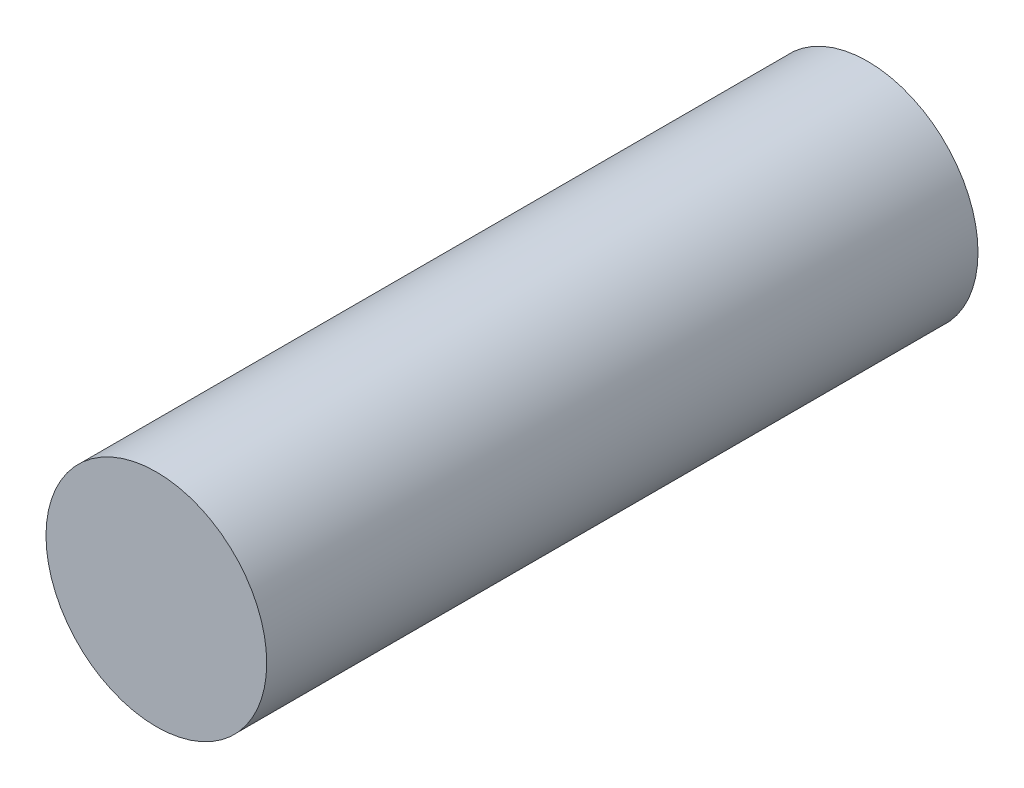
ISO-10303-21;
HEADER;
FILE_DESCRIPTION(('STEP AP214'),'2;1');
FILE_NAME('part.step','',(''),(''),'','','');
FILE_SCHEMA(('AUTOMOTIVE_DESIGN { 1 0 10303 214 1 1 1 1 }'));
ENDSEC;
DATA;
#1=APPLICATION_CONTEXT('core data for automotive mechanical design processes');
#2=APPLICATION_PROTOCOL_DEFINITION('international standard','automotive_design',2000,#1);
#3=PRODUCT_CONTEXT('',#1,'mechanical');
#4=PRODUCT('Part','Part','',(#3));
#5=PRODUCT_RELATED_PRODUCT_CATEGORY('part','',(#4));
#6=PRODUCT_DEFINITION_FORMATION('','',#4);
#7=PRODUCT_DEFINITION_CONTEXT('part definition',#1,'design');
#8=PRODUCT_DEFINITION('design','',#6,#7);
#9=PRODUCT_DEFINITION_SHAPE('','',#8);
#10=(LENGTH_UNIT() NAMED_UNIT(*) SI_UNIT(.MILLI.,.METRE.));
#11=(NAMED_UNIT(*) PLANE_ANGLE_UNIT() SI_UNIT($,.RADIAN.));
#12=(NAMED_UNIT(*) SI_UNIT($,.STERADIAN.) SOLID_ANGLE_UNIT());
#13=UNCERTAINTY_MEASURE_WITH_UNIT(LENGTH_MEASURE(1.E-05),#10,'distance_accuracy_value','');
#14=(GEOMETRIC_REPRESENTATION_CONTEXT(3) GLOBAL_UNCERTAINTY_ASSIGNED_CONTEXT((#13)) GLOBAL_UNIT_ASSIGNED_CONTEXT((#10,
#11,#12)) REPRESENTATION_CONTEXT('',''));
#15=CARTESIAN_POINT('',(0.,0.,0.));
#16=DIRECTION('',(0.,0.,1.));
#17=DIRECTION('',(1.,0.,0.));
#18=AXIS2_PLACEMENT_3D('',#15,#16,#17);
#19=CARTESIAN_POINT('',(-0.0226601259214476,-0.00635432712670081,16.1126715611951));
#20=DIRECTION('',(0.,0.,-1.));
#21=DIRECTION('',(-1.,0.,0.));
#22=AXIS2_PLACEMENT_3D('',#19,#20,#21);
#23=CYLINDRICAL_SURFACE('',#22,2.5);
#24=CARTESIAN_POINT('',(-0.0226601259214476,-0.00635432712670081,16.1126715611951));
#25=DIRECTION('',(0.,0.,1.));
#26=DIRECTION('',(1.,0.,0.));
#27=AXIS2_PLACEMENT_3D('',#24,#25,#26);
#28=CIRCLE('',#27,2.5);
#29=CARTESIAN_POINT('',(2.47733987407855,-0.00635432712670081,16.1126715611951));
#30=VERTEX_POINT('',#29);
#31=EDGE_CURVE('E10',#30,#30,#28,.T.);
#32=ORIENTED_EDGE('',*,*,#31,.F.);
#33=EDGE_LOOP('',(#32));
#34=FACE_BOUND('',#33,.T.);
#35=CARTESIAN_POINT('',(-0.0226601259214476,-0.00635432712670081,0.));
#36=DIRECTION('',(0.,0.,1.));
#37=DIRECTION('',(1.,0.,0.));
#38=AXIS2_PLACEMENT_3D('',#35,#36,#37);
#39=CIRCLE('',#38,2.5);
#40=CARTESIAN_POINT('',(2.47733987407855,-0.00635432712670081,0.));
#41=VERTEX_POINT('',#40);
#42=EDGE_CURVE('E40',#41,#41,#39,.T.);
#43=ORIENTED_EDGE('',*,*,#42,.T.);
#44=EDGE_LOOP('',(#43));
#45=FACE_BOUND('',#44,.T.);
#46=ADVANCED_FACE('F37',(#34,#45),#23,.T.);
#47=CARTESIAN_POINT('',(-0.0226601259214476,-0.00635432712670081,16.1126715611951));
#48=DIRECTION('',(0.,0.,1.));
#49=DIRECTION('',(1.,0.,0.));
#50=AXIS2_PLACEMENT_3D('',#47,#48,#49);
#51=PLANE('',#50);
#52=ORIENTED_EDGE('',*,*,#31,.T.);
#53=EDGE_LOOP('',(#52));
#54=FACE_BOUND('',#53,.T.);
#55=ADVANCED_FACE('F54',(#54),#51,.T.);
#56=CARTESIAN_POINT('',(-0.0226601259214476,-0.00635432712670081,0.));
#57=DIRECTION('',(0.,0.,1.));
#58=DIRECTION('',(1.,0.,0.));
#59=AXIS2_PLACEMENT_3D('',#56,#57,#58);
#60=PLANE('',#59);
#61=ORIENTED_EDGE('',*,*,#42,.F.);
#62=EDGE_LOOP('',(#61));
#63=FACE_BOUND('',#62,.T.);
#64=ADVANCED_FACE('F52',(#63),#60,.F.);
#65=CLOSED_SHELL('',(#46,#55,#64));
#66=MANIFOLD_SOLID_BREP('B2',#65);
#67=ADVANCED_BREP_SHAPE_REPRESENTATION('',(#18,#66),#14);
#68=SHAPE_DEFINITION_REPRESENTATION(#9,#67);
ENDSEC;
END-ISO-10303-21;
